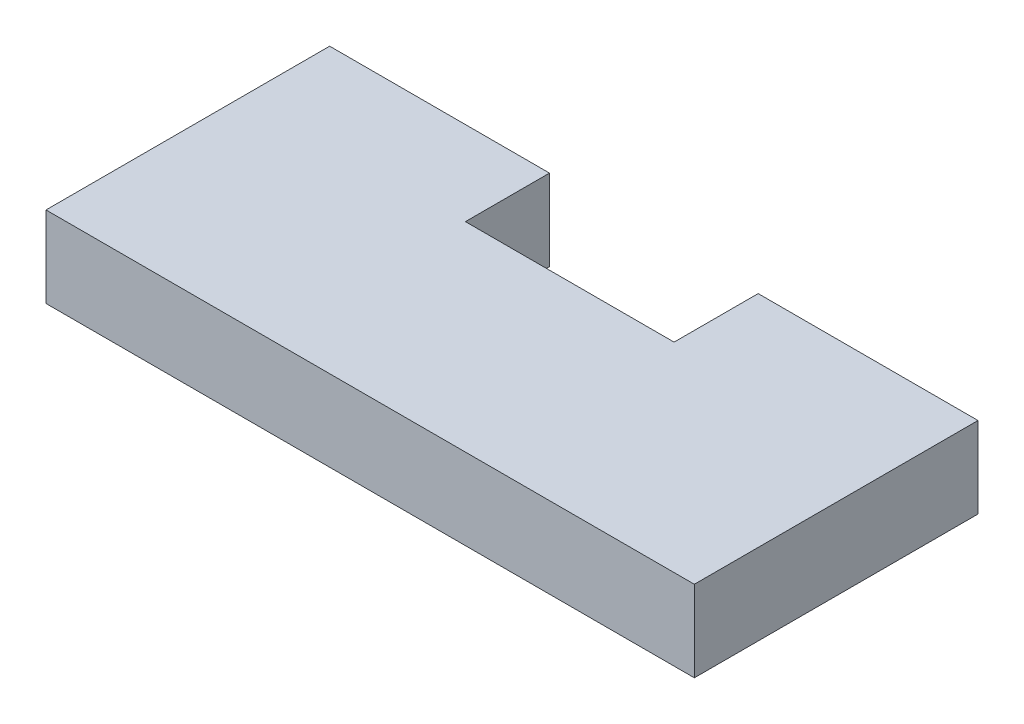
ISO-10303-21;
HEADER;
FILE_DESCRIPTION(('STEP AP214'),'2;1');
FILE_NAME('part.step','',(''),(''),'','','');
FILE_SCHEMA(('AUTOMOTIVE_DESIGN { 1 0 10303 214 1 1 1 1 }'));
ENDSEC;
DATA;
#1=APPLICATION_CONTEXT('core data for automotive mechanical design processes');
#2=APPLICATION_PROTOCOL_DEFINITION('international standard','automotive_design',2000,#1);
#3=PRODUCT_CONTEXT('',#1,'mechanical');
#4=PRODUCT('Part','Part','',(#3));
#5=PRODUCT_RELATED_PRODUCT_CATEGORY('part','',(#4));
#6=PRODUCT_DEFINITION_FORMATION('','',#4);
#7=PRODUCT_DEFINITION_CONTEXT('part definition',#1,'design');
#8=PRODUCT_DEFINITION('design','',#6,#7);
#9=PRODUCT_DEFINITION_SHAPE('','',#8);
#10=(LENGTH_UNIT() NAMED_UNIT(*) SI_UNIT(.MILLI.,.METRE.));
#11=(NAMED_UNIT(*) PLANE_ANGLE_UNIT() SI_UNIT($,.RADIAN.));
#12=(NAMED_UNIT(*) SI_UNIT($,.STERADIAN.) SOLID_ANGLE_UNIT());
#13=UNCERTAINTY_MEASURE_WITH_UNIT(LENGTH_MEASURE(1.E-05),#10,'distance_accuracy_value','');
#14=(GEOMETRIC_REPRESENTATION_CONTEXT(3) GLOBAL_UNCERTAINTY_ASSIGNED_CONTEXT((#13)) GLOBAL_UNIT_ASSIGNED_CONTEXT((#10,
#11,#12)) REPRESENTATION_CONTEXT('',''));
#15=CARTESIAN_POINT('',(0.,0.,0.));
#16=DIRECTION('',(0.,0.,1.));
#17=DIRECTION('',(1.,0.,0.));
#18=AXIS2_PLACEMENT_3D('',#15,#16,#17);
#19=CARTESIAN_POINT('',(16.,4.,0.));
#20=DIRECTION('',(-1.,0.,0.));
#21=DIRECTION('',(0.,0.,1.));
#22=AXIS2_PLACEMENT_3D('',#19,#20,#21);
#23=PLANE('',#22);
#24=DIRECTION('',(0.,0.,-1.));
#25=VECTOR('',#24,1.);
#26=CARTESIAN_POINT('',(16.,0.,0.));
#27=LINE('',#26,#25);
#28=CARTESIAN_POINT('',(16.,0.,0.));
#29=VERTEX_POINT('',#28);
#30=CARTESIAN_POINT('',(16.,0.,-14.));
#31=VERTEX_POINT('',#30);
#32=EDGE_CURVE('E130',#29,#31,#27,.T.);
#33=ORIENTED_EDGE('',*,*,#32,.T.);
#34=DIRECTION('',(0.,-1.,0.));
#35=VECTOR('',#34,1.);
#36=CARTESIAN_POINT('',(16.,4.,-14.));
#37=LINE('',#36,#35);
#38=CARTESIAN_POINT('',(16.,4.,-14.));
#39=VERTEX_POINT('',#38);
#40=EDGE_CURVE('E11',#39,#31,#37,.T.);
#41=ORIENTED_EDGE('',*,*,#40,.F.);
#42=DIRECTION('',(0.,0.,-1.));
#43=VECTOR('',#42,1.);
#44=CARTESIAN_POINT('',(16.,4.,0.));
#45=LINE('',#44,#43);
#46=CARTESIAN_POINT('',(16.,4.,0.));
#47=VERTEX_POINT('',#46);
#48=EDGE_CURVE('E144',#47,#39,#45,.T.);
#49=ORIENTED_EDGE('',*,*,#48,.F.);
#50=DIRECTION('',(0.,-1.,0.));
#51=VECTOR('',#50,1.);
#52=CARTESIAN_POINT('',(16.,4.,0.));
#53=LINE('',#52,#51);
#54=EDGE_CURVE('E126',#47,#29,#53,.T.);
#55=ORIENTED_EDGE('',*,*,#54,.T.);
#56=EDGE_LOOP('',(#33,#41,#49,#55));
#57=FACE_BOUND('',#56,.T.);
#58=ADVANCED_FACE('F34',(#57),#23,.F.);
#59=CARTESIAN_POINT('',(16.,4.,-14.));
#60=DIRECTION('',(0.,0.,1.));
#61=DIRECTION('',(1.,0.,0.));
#62=AXIS2_PLACEMENT_3D('',#59,#60,#61);
#63=PLANE('',#62);
#64=DIRECTION('',(-1.,0.,0.));
#65=VECTOR('',#64,1.);
#66=CARTESIAN_POINT('',(16.,0.,-14.));
#67=LINE('',#66,#65);
#68=CARTESIAN_POINT('',(5.15,0.,-14.));
#69=VERTEX_POINT('',#68);
#70=EDGE_CURVE('E133',#31,#69,#67,.T.);
#71=ORIENTED_EDGE('',*,*,#70,.T.);
#72=DIRECTION('',(0.,-1.,0.));
#73=VECTOR('',#72,1.);
#74=CARTESIAN_POINT('',(5.15,4.,-14.));
#75=LINE('',#74,#73);
#76=CARTESIAN_POINT('',(5.15,4.,-14.));
#77=VERTEX_POINT('',#76);
#78=EDGE_CURVE('E42',#77,#69,#75,.T.);
#79=ORIENTED_EDGE('',*,*,#78,.F.);
#80=DIRECTION('',(-1.,0.,0.));
#81=VECTOR('',#80,1.);
#82=CARTESIAN_POINT('',(16.,4.,-14.));
#83=LINE('',#82,#81);
#84=EDGE_CURVE('E93',#39,#77,#83,.T.);
#85=ORIENTED_EDGE('',*,*,#84,.F.);
#86=ORIENTED_EDGE('',*,*,#40,.T.);
#87=EDGE_LOOP('',(#71,#79,#85,#86));
#88=FACE_BOUND('',#87,.T.);
#89=ADVANCED_FACE('F179',(#88),#63,.F.);
#90=CARTESIAN_POINT('',(5.15,4.,-14.));
#91=DIRECTION('',(1.,0.,0.));
#92=DIRECTION('',(0.,0.,-1.));
#93=AXIS2_PLACEMENT_3D('',#90,#91,#92);
#94=PLANE('',#93);
#95=DIRECTION('',(0.,0.,1.));
#96=VECTOR('',#95,1.);
#97=CARTESIAN_POINT('',(5.15,0.,-14.));
#98=LINE('',#97,#96);
#99=CARTESIAN_POINT('',(5.15,0.,-9.85));
#100=VERTEX_POINT('',#99);
#101=EDGE_CURVE('E135',#69,#100,#98,.T.);
#102=ORIENTED_EDGE('',*,*,#101,.T.);
#103=DIRECTION('',(0.,-1.,0.));
#104=VECTOR('',#103,1.);
#105=CARTESIAN_POINT('',(5.15,4.,-9.85));
#106=LINE('',#105,#104);
#107=CARTESIAN_POINT('',(5.15,4.,-9.85));
#108=VERTEX_POINT('',#107);
#109=EDGE_CURVE('E151',#108,#100,#106,.T.);
#110=ORIENTED_EDGE('',*,*,#109,.F.);
#111=DIRECTION('',(0.,0.,1.));
#112=VECTOR('',#111,1.);
#113=CARTESIAN_POINT('',(5.15,4.,-14.));
#114=LINE('',#113,#112);
#115=EDGE_CURVE('E159',#77,#108,#114,.T.);
#116=ORIENTED_EDGE('',*,*,#115,.F.);
#117=ORIENTED_EDGE('',*,*,#78,.T.);
#118=EDGE_LOOP('',(#102,#110,#116,#117));
#119=FACE_BOUND('',#118,.T.);
#120=ADVANCED_FACE('F157',(#119),#94,.F.);
#121=CARTESIAN_POINT('',(5.15,4.,-9.85));
#122=DIRECTION('',(0.,0.,1.));
#123=DIRECTION('',(1.,0.,0.));
#124=AXIS2_PLACEMENT_3D('',#121,#122,#123);
#125=PLANE('',#124);
#126=DIRECTION('',(-1.,0.,0.));
#127=VECTOR('',#126,1.);
#128=CARTESIAN_POINT('',(5.15,0.,-9.85));
#129=LINE('',#128,#127);
#130=CARTESIAN_POINT('',(-5.15,0.,-9.85));
#131=VERTEX_POINT('',#130);
#132=EDGE_CURVE('E137',#100,#131,#129,.T.);
#133=ORIENTED_EDGE('',*,*,#132,.T.);
#134=DIRECTION('',(0.,-1.,0.));
#135=VECTOR('',#134,1.);
#136=CARTESIAN_POINT('',(-5.15,4.,-9.85));
#137=LINE('',#136,#135);
#138=CARTESIAN_POINT('',(-5.15,4.,-9.85));
#139=VERTEX_POINT('',#138);
#140=EDGE_CURVE('E148',#139,#131,#137,.T.);
#141=ORIENTED_EDGE('',*,*,#140,.F.);
#142=DIRECTION('',(-1.,0.,0.));
#143=VECTOR('',#142,1.);
#144=CARTESIAN_POINT('',(5.15,4.,-9.85));
#145=LINE('',#144,#143);
#146=EDGE_CURVE('E171',#108,#139,#145,.T.);
#147=ORIENTED_EDGE('',*,*,#146,.F.);
#148=ORIENTED_EDGE('',*,*,#109,.T.);
#149=EDGE_LOOP('',(#133,#141,#147,#148));
#150=FACE_BOUND('',#149,.T.);
#151=ADVANCED_FACE('F167',(#150),#125,.F.);
#152=CARTESIAN_POINT('',(-5.15,4.,-9.85));
#153=DIRECTION('',(-1.,0.,0.));
#154=DIRECTION('',(0.,0.,1.));
#155=AXIS2_PLACEMENT_3D('',#152,#153,#154);
#156=PLANE('',#155);
#157=DIRECTION('',(0.,0.,-1.));
#158=VECTOR('',#157,1.);
#159=CARTESIAN_POINT('',(-5.15,0.,-9.85));
#160=LINE('',#159,#158);
#161=CARTESIAN_POINT('',(-5.15,0.,-14.));
#162=VERTEX_POINT('',#161);
#163=EDGE_CURVE('E139',#131,#162,#160,.T.);
#164=ORIENTED_EDGE('',*,*,#163,.T.);
#165=DIRECTION('',(0.,-1.,0.));
#166=VECTOR('',#165,1.);
#167=CARTESIAN_POINT('',(-5.15,4.,-14.));
#168=LINE('',#167,#166);
#169=CARTESIAN_POINT('',(-5.15,4.,-14.));
#170=VERTEX_POINT('',#169);
#171=EDGE_CURVE('E121',#170,#162,#168,.T.);
#172=ORIENTED_EDGE('',*,*,#171,.F.);
#173=DIRECTION('',(0.,0.,-1.));
#174=VECTOR('',#173,1.);
#175=CARTESIAN_POINT('',(-5.15,4.,-9.85));
#176=LINE('',#175,#174);
#177=EDGE_CURVE('E112',#139,#170,#176,.T.);
#178=ORIENTED_EDGE('',*,*,#177,.F.);
#179=ORIENTED_EDGE('',*,*,#140,.T.);
#180=EDGE_LOOP('',(#164,#172,#178,#179));
#181=FACE_BOUND('',#180,.T.);
#182=ADVANCED_FACE('F170',(#181),#156,.F.);
#183=CARTESIAN_POINT('',(-5.15,4.,-14.));
#184=DIRECTION('',(0.,0.,1.));
#185=DIRECTION('',(1.,0.,0.));
#186=AXIS2_PLACEMENT_3D('',#183,#184,#185);
#187=PLANE('',#186);
#188=DIRECTION('',(-1.,0.,0.));
#189=VECTOR('',#188,1.);
#190=CARTESIAN_POINT('',(-5.15,0.,-14.));
#191=LINE('',#190,#189);
#192=CARTESIAN_POINT('',(-16.,0.,-14.));
#193=VERTEX_POINT('',#192);
#194=EDGE_CURVE('E120',#162,#193,#191,.T.);
#195=ORIENTED_EDGE('',*,*,#194,.T.);
#196=DIRECTION('',(0.,-1.,0.));
#197=VECTOR('',#196,1.);
#198=CARTESIAN_POINT('',(-16.,4.,-14.));
#199=LINE('',#198,#197);
#200=CARTESIAN_POINT('',(-16.,4.,-14.));
#201=VERTEX_POINT('',#200);
#202=EDGE_CURVE('E117',#201,#193,#199,.T.);
#203=ORIENTED_EDGE('',*,*,#202,.F.);
#204=DIRECTION('',(-1.,0.,0.));
#205=VECTOR('',#204,1.);
#206=CARTESIAN_POINT('',(-5.15,4.,-14.));
#207=LINE('',#206,#205);
#208=EDGE_CURVE('E106',#170,#201,#207,.T.);
#209=ORIENTED_EDGE('',*,*,#208,.F.);
#210=ORIENTED_EDGE('',*,*,#171,.T.);
#211=EDGE_LOOP('',(#195,#203,#209,#210));
#212=FACE_BOUND('',#211,.T.);
#213=ADVANCED_FACE('F118',(#212),#187,.F.);
#214=CARTESIAN_POINT('',(-16.,4.,-14.));
#215=DIRECTION('',(1.,0.,0.));
#216=DIRECTION('',(0.,0.,-1.));
#217=AXIS2_PLACEMENT_3D('',#214,#215,#216);
#218=PLANE('',#217);
#219=DIRECTION('',(0.,0.,1.));
#220=VECTOR('',#219,1.);
#221=CARTESIAN_POINT('',(-16.,0.,-14.));
#222=LINE('',#221,#220);
#223=CARTESIAN_POINT('',(-16.,0.,0.));
#224=VERTEX_POINT('',#223);
#225=EDGE_CURVE('E79',#193,#224,#222,.T.);
#226=ORIENTED_EDGE('',*,*,#225,.T.);
#227=DIRECTION('',(0.,-1.,0.));
#228=VECTOR('',#227,1.);
#229=CARTESIAN_POINT('',(-16.,4.,0.));
#230=LINE('',#229,#228);
#231=CARTESIAN_POINT('',(-16.,4.,0.));
#232=VERTEX_POINT('',#231);
#233=EDGE_CURVE('E122',#232,#224,#230,.T.);
#234=ORIENTED_EDGE('',*,*,#233,.F.);
#235=DIRECTION('',(0.,0.,1.));
#236=VECTOR('',#235,1.);
#237=CARTESIAN_POINT('',(-16.,4.,-14.));
#238=LINE('',#237,#236);
#239=EDGE_CURVE('E110',#201,#232,#238,.T.);
#240=ORIENTED_EDGE('',*,*,#239,.F.);
#241=ORIENTED_EDGE('',*,*,#202,.T.);
#242=EDGE_LOOP('',(#226,#234,#240,#241));
#243=FACE_BOUND('',#242,.T.);
#244=ADVANCED_FACE('F124',(#243),#218,.F.);
#245=CARTESIAN_POINT('',(-16.,4.,0.));
#246=DIRECTION('',(0.,0.,-1.));
#247=DIRECTION('',(-1.,0.,0.));
#248=AXIS2_PLACEMENT_3D('',#245,#246,#247);
#249=PLANE('',#248);
#250=DIRECTION('',(1.,0.,0.));
#251=VECTOR('',#250,1.);
#252=CARTESIAN_POINT('',(-16.,0.,0.));
#253=LINE('',#252,#251);
#254=EDGE_CURVE('E85',#224,#29,#253,.T.);
#255=ORIENTED_EDGE('',*,*,#254,.T.);
#256=ORIENTED_EDGE('',*,*,#54,.F.);
#257=DIRECTION('',(1.,0.,0.));
#258=VECTOR('',#257,1.);
#259=CARTESIAN_POINT('',(-16.,4.,0.));
#260=LINE('',#259,#258);
#261=EDGE_CURVE('E50',#232,#47,#260,.T.);
#262=ORIENTED_EDGE('',*,*,#261,.F.);
#263=ORIENTED_EDGE('',*,*,#233,.T.);
#264=EDGE_LOOP('',(#255,#256,#262,#263));
#265=FACE_BOUND('',#264,.T.);
#266=ADVANCED_FACE('F195',(#265),#249,.F.);
#267=CARTESIAN_POINT('',(0.,4.,0.));
#268=DIRECTION('',(0.,1.,0.));
#269=DIRECTION('',(0.,0.,1.));
#270=AXIS2_PLACEMENT_3D('',#267,#268,#269);
#271=PLANE('',#270);
#272=ORIENTED_EDGE('',*,*,#48,.T.);
#273=ORIENTED_EDGE('',*,*,#84,.T.);
#274=ORIENTED_EDGE('',*,*,#115,.T.);
#275=ORIENTED_EDGE('',*,*,#146,.T.);
#276=ORIENTED_EDGE('',*,*,#177,.T.);
#277=ORIENTED_EDGE('',*,*,#208,.T.);
#278=ORIENTED_EDGE('',*,*,#239,.T.);
#279=ORIENTED_EDGE('',*,*,#261,.T.);
#280=EDGE_LOOP('',(#272,#273,#274,#275,#276,#277,#278,#279));
#281=FACE_BOUND('',#280,.T.);
#282=ADVANCED_FACE('F108',(#281),#271,.T.);
#283=CARTESIAN_POINT('',(0.,0.,0.));
#284=DIRECTION('',(0.,1.,0.));
#285=DIRECTION('',(0.,0.,1.));
#286=AXIS2_PLACEMENT_3D('',#283,#284,#285);
#287=PLANE('',#286);
#288=ORIENTED_EDGE('',*,*,#32,.F.);
#289=ORIENTED_EDGE('',*,*,#254,.F.);
#290=ORIENTED_EDGE('',*,*,#225,.F.);
#291=ORIENTED_EDGE('',*,*,#194,.F.);
#292=ORIENTED_EDGE('',*,*,#163,.F.);
#293=ORIENTED_EDGE('',*,*,#132,.F.);
#294=ORIENTED_EDGE('',*,*,#101,.F.);
#295=ORIENTED_EDGE('',*,*,#70,.F.);
#296=EDGE_LOOP('',(#288,#289,#290,#291,#292,#293,#294,#295));
#297=FACE_BOUND('',#296,.T.);
#298=ADVANCED_FACE('F163',(#297),#287,.F.);
#299=CLOSED_SHELL('',(#58,#89,#120,#151,#182,#213,#244,#266,#282,#298));
#300=MANIFOLD_SOLID_BREP('B2',#299);
#301=ADVANCED_BREP_SHAPE_REPRESENTATION('',(#18,#300),#14);
#302=SHAPE_DEFINITION_REPRESENTATION(#9,#301);
ENDSEC;
END-ISO-10303-21;
